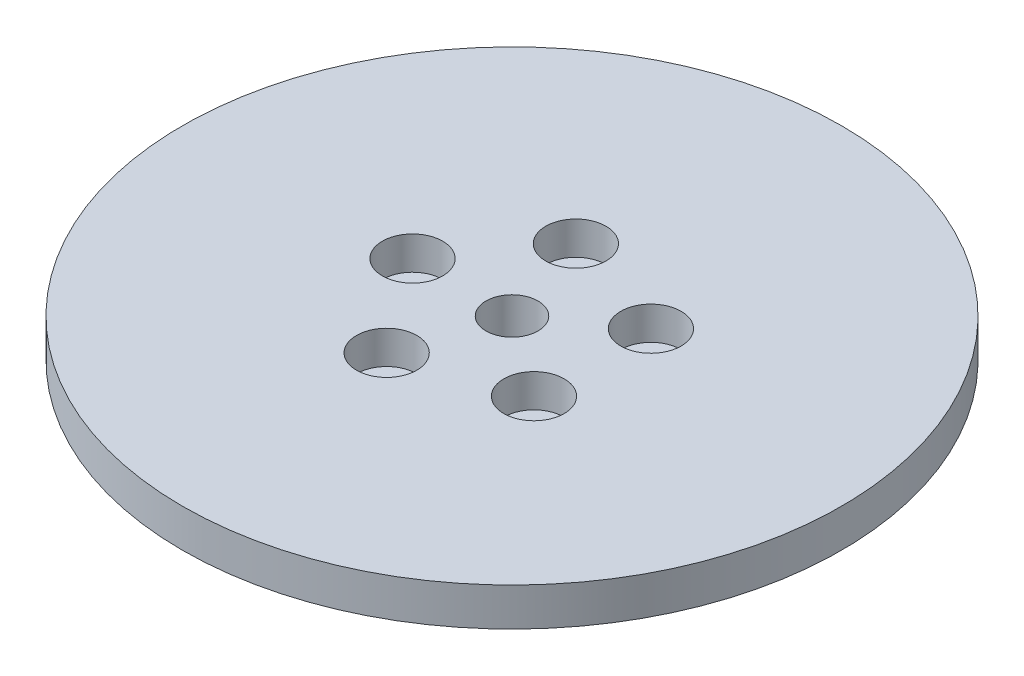
ISO-10303-21;
HEADER;
FILE_DESCRIPTION(('STEP AP214'),'2;1');
FILE_NAME('part.step','',(''),(''),'','','');
FILE_SCHEMA(('AUTOMOTIVE_DESIGN { 1 0 10303 214 1 1 1 1 }'));
ENDSEC;
DATA;
#1=APPLICATION_CONTEXT('core data for automotive mechanical design processes');
#2=APPLICATION_PROTOCOL_DEFINITION('international standard','automotive_design',2000,#1);
#3=PRODUCT_CONTEXT('',#1,'mechanical');
#4=PRODUCT('Part','Part','',(#3));
#5=PRODUCT_RELATED_PRODUCT_CATEGORY('part','',(#4));
#6=PRODUCT_DEFINITION_FORMATION('','',#4);
#7=PRODUCT_DEFINITION_CONTEXT('part definition',#1,'design');
#8=PRODUCT_DEFINITION('design','',#6,#7);
#9=PRODUCT_DEFINITION_SHAPE('','',#8);
#10=(LENGTH_UNIT() NAMED_UNIT(*) SI_UNIT(.MILLI.,.METRE.));
#11=(NAMED_UNIT(*) PLANE_ANGLE_UNIT() SI_UNIT($,.RADIAN.));
#12=(NAMED_UNIT(*) SI_UNIT($,.STERADIAN.) SOLID_ANGLE_UNIT());
#13=UNCERTAINTY_MEASURE_WITH_UNIT(LENGTH_MEASURE(1.E-05),#10,'distance_accuracy_value','');
#14=(GEOMETRIC_REPRESENTATION_CONTEXT(3) GLOBAL_UNCERTAINTY_ASSIGNED_CONTEXT((#13)) GLOBAL_UNIT_ASSIGNED_CONTEXT((#10,
#11,#12)) REPRESENTATION_CONTEXT('',''));
#15=CARTESIAN_POINT('',(0.,0.,0.));
#16=DIRECTION('',(0.,0.,1.));
#17=DIRECTION('',(1.,0.,0.));
#18=AXIS2_PLACEMENT_3D('',#15,#16,#17);
#19=CARTESIAN_POINT('',(0.,11.,0.));
#20=DIRECTION('',(0.,-1.,0.));
#21=DIRECTION('',(0.,0.,-1.));
#22=AXIS2_PLACEMENT_3D('',#19,#20,#21);
#23=CYLINDRICAL_SURFACE('',#22,95.);
#24=CARTESIAN_POINT('',(0.,11.,0.));
#25=DIRECTION('',(0.,1.,0.));
#26=DIRECTION('',(0.,0.,1.));
#27=AXIS2_PLACEMENT_3D('',#24,#25,#26);
#28=CIRCLE('',#27,95.);
#29=CARTESIAN_POINT('',(0.,11.,95.));
#30=VERTEX_POINT('',#29);
#31=EDGE_CURVE('E10',#30,#30,#28,.T.);
#32=ORIENTED_EDGE('',*,*,#31,.F.);
#33=EDGE_LOOP('',(#32));
#34=FACE_BOUND('',#33,.T.);
#35=CARTESIAN_POINT('',(0.,0.,0.));
#36=DIRECTION('',(0.,1.,0.));
#37=DIRECTION('',(0.,0.,1.));
#38=AXIS2_PLACEMENT_3D('',#35,#36,#37);
#39=CIRCLE('',#38,95.);
#40=CARTESIAN_POINT('',(0.,0.,95.));
#41=VERTEX_POINT('',#40);
#42=EDGE_CURVE('E37',#41,#41,#39,.T.);
#43=ORIENTED_EDGE('',*,*,#42,.T.);
#44=EDGE_LOOP('',(#43));
#45=FACE_BOUND('',#44,.T.);
#46=ADVANCED_FACE('F40',(#34,#45),#23,.T.);
#47=CARTESIAN_POINT('',(0.,11.,0.));
#48=DIRECTION('',(0.,1.,0.));
#49=DIRECTION('',(0.,0.,1.));
#50=AXIS2_PLACEMENT_3D('',#47,#48,#49);
#51=PLANE('',#50);
#52=CARTESIAN_POINT('',(-8.86063281050271,11.,-27.270223729838));
#53=DIRECTION('',(0.,1.,0.));
#54=DIRECTION('',(-0.95105651629515,0.,0.309016994374958));
#55=AXIS2_PLACEMENT_3D('',#52,#53,#54);
#56=CIRCLE('',#55,8.69065040809146);
#57=CARTESIAN_POINT('',(-17.1259325119612,11.,-24.5846650615661));
#58=VERTEX_POINT('',#57);
#59=EDGE_CURVE('E70',#58,#58,#56,.T.);
#60=ORIENTED_EDGE('',*,*,#59,.F.);
#61=EDGE_LOOP('',(#60));
#62=FACE_BOUND('',#61,.T.);
#63=CARTESIAN_POINT('',(23.1974378597276,11.,-16.8539251458541));
#64=DIRECTION('',(0.,1.,0.));
#65=DIRECTION('',(-0.58778525229248,0.,-0.809016994374942));
#66=AXIS2_PLACEMENT_3D('',#63,#64,#65);
#67=CIRCLE('',#66,8.69065040809146);
#68=CARTESIAN_POINT('',(18.0892017170219,11.,-23.8848090181716));
#69=VERTEX_POINT('',#68);
#70=EDGE_CURVE('E71',#69,#69,#67,.T.);
#71=ORIENTED_EDGE('',*,*,#70,.F.);
#72=EDGE_LOOP('',(#71));
#73=FACE_BOUND('',#72,.T.);
#74=CARTESIAN_POINT('',(23.1974378597279,11.,16.8539251458538));
#75=DIRECTION('',(0.,1.,0.));
#76=DIRECTION('',(0.587785252292469,0.,-0.809016994374951));
#77=AXIS2_PLACEMENT_3D('',#74,#75,#76);
#78=CIRCLE('',#77,8.69065040809146);
#79=CARTESIAN_POINT('',(28.3056740024336,11.,9.82304127353618));
#80=VERTEX_POINT('',#79);
#81=EDGE_CURVE('E78',#80,#80,#78,.T.);
#82=ORIENTED_EDGE('',*,*,#81,.F.);
#83=EDGE_LOOP('',(#82));
#84=FACE_BOUND('',#83,.T.);
#85=CARTESIAN_POINT('',(-8.86063281050233,11.,27.2702237298382));
#86=DIRECTION('',(0.,1.,0.));
#87=DIRECTION('',(0.951056516295155,0.,0.309016994374945));
#88=AXIS2_PLACEMENT_3D('',#85,#86,#87);
#89=CIRCLE('',#88,8.69065040809146);
#90=CARTESIAN_POINT('',(-0.595333109043798,11.,29.95578239811));
#91=VERTEX_POINT('',#90);
#92=EDGE_CURVE('E61',#91,#91,#89,.T.);
#93=ORIENTED_EDGE('',*,*,#92,.F.);
#94=EDGE_LOOP('',(#93));
#95=FACE_BOUND('',#94,.T.);
#96=CARTESIAN_POINT('',(-28.6736100984508,11.,0.));
#97=DIRECTION('',(0.,1.,0.));
#98=DIRECTION('',(0.,0.,1.));
#99=AXIS2_PLACEMENT_3D('',#96,#97,#98);
#100=CIRCLE('',#99,8.69065040809146);
#101=CARTESIAN_POINT('',(-28.6736100984508,11.,8.69065040809146));
#102=VERTEX_POINT('',#101);
#103=EDGE_CURVE('E54',#102,#102,#100,.T.);
#104=ORIENTED_EDGE('',*,*,#103,.F.);
#105=EDGE_LOOP('',(#104));
#106=FACE_BOUND('',#105,.T.);
#107=CARTESIAN_POINT('',(0.,11.,0.));
#108=DIRECTION('',(0.,1.,0.));
#109=DIRECTION('',(0.,0.,1.));
#110=AXIS2_PLACEMENT_3D('',#107,#108,#109);
#111=CIRCLE('',#110,7.5);
#112=CARTESIAN_POINT('',(0.,11.,7.5));
#113=VERTEX_POINT('',#112);
#114=EDGE_CURVE('E50',#113,#113,#111,.T.);
#115=ORIENTED_EDGE('',*,*,#114,.F.);
#116=EDGE_LOOP('',(#115));
#117=FACE_BOUND('',#116,.T.);
#118=ORIENTED_EDGE('',*,*,#31,.T.);
#119=EDGE_LOOP('',(#118));
#120=FACE_BOUND('',#119,.T.);
#121=ADVANCED_FACE('F94',(#62,#73,#84,#95,#106,#117,#120),#51,.T.);
#122=CARTESIAN_POINT('',(0.,0.,0.));
#123=DIRECTION('',(0.,1.,0.));
#124=DIRECTION('',(0.,0.,1.));
#125=AXIS2_PLACEMENT_3D('',#122,#123,#124);
#126=PLANE('',#125);
#127=CARTESIAN_POINT('',(0.,0.,0.));
#128=DIRECTION('',(0.,1.,0.));
#129=DIRECTION('',(0.,0.,1.));
#130=AXIS2_PLACEMENT_3D('',#127,#128,#129);
#131=CIRCLE('',#130,7.5);
#132=CARTESIAN_POINT('',(0.,0.,7.5));
#133=VERTEX_POINT('',#132);
#134=EDGE_CURVE('E47',#133,#133,#131,.T.);
#135=ORIENTED_EDGE('',*,*,#134,.T.);
#136=EDGE_LOOP('',(#135));
#137=FACE_BOUND('',#136,.T.);
#138=ORIENTED_EDGE('',*,*,#42,.F.);
#139=EDGE_LOOP('',(#138));
#140=FACE_BOUND('',#139,.T.);
#141=ADVANCED_FACE('F100',(#137,#140),#126,.F.);
#142=CARTESIAN_POINT('',(0.,11.,0.));
#143=DIRECTION('',(0.,-1.,0.));
#144=DIRECTION('',(0.,0.,-1.));
#145=AXIS2_PLACEMENT_3D('',#142,#143,#144);
#146=CYLINDRICAL_SURFACE('',#145,7.5);
#147=ORIENTED_EDGE('',*,*,#114,.T.);
#148=EDGE_LOOP('',(#147));
#149=FACE_BOUND('',#148,.T.);
#150=ORIENTED_EDGE('',*,*,#134,.F.);
#151=EDGE_LOOP('',(#150));
#152=FACE_BOUND('',#151,.T.);
#153=ADVANCED_FACE('F106',(#149,#152),#146,.F.);
#154=CARTESIAN_POINT('',(-28.6736100984508,1.44149925813768,0.));
#155=DIRECTION('',(0.,1.,0.));
#156=DIRECTION('',(0.,0.,1.));
#157=AXIS2_PLACEMENT_3D('',#154,#155,#156);
#158=CYLINDRICAL_SURFACE('',#157,8.69065040809146);
#159=CARTESIAN_POINT('',(-28.6736100984508,1.44149925813768,0.));
#160=DIRECTION('',(0.,1.,0.));
#161=DIRECTION('',(0.,0.,1.));
#162=AXIS2_PLACEMENT_3D('',#159,#160,#161);
#163=CIRCLE('',#162,8.69065040809146);
#164=CARTESIAN_POINT('',(-28.6736100984508,1.44149925813768,8.69065040809146));
#165=VERTEX_POINT('',#164);
#166=EDGE_CURVE('E55',#165,#165,#163,.T.);
#167=ORIENTED_EDGE('',*,*,#166,.F.);
#168=EDGE_LOOP('',(#167));
#169=FACE_BOUND('',#168,.T.);
#170=ORIENTED_EDGE('',*,*,#103,.T.);
#171=EDGE_LOOP('',(#170));
#172=FACE_BOUND('',#171,.T.);
#173=ADVANCED_FACE('F108',(#169,#172),#158,.F.);
#174=CARTESIAN_POINT('',(-28.6736100984508,1.44149925813768,0.));
#175=DIRECTION('',(0.,1.,0.));
#176=DIRECTION('',(0.,0.,1.));
#177=AXIS2_PLACEMENT_3D('',#174,#175,#176);
#178=PLANE('',#177);
#179=ORIENTED_EDGE('',*,*,#166,.T.);
#180=EDGE_LOOP('',(#179));
#181=FACE_BOUND('',#180,.T.);
#182=ADVANCED_FACE('F138',(#181),#178,.T.);
#183=CARTESIAN_POINT('',(-8.86063281050233,1.44149925813768,27.2702237298382));
#184=DIRECTION('',(0.,1.,0.));
#185=DIRECTION('',(0.,0.,1.));
#186=AXIS2_PLACEMENT_3D('',#183,#184,#185);
#187=CYLINDRICAL_SURFACE('',#186,8.69065040809146);
#188=CARTESIAN_POINT('',(-8.86063281050233,1.44149925813768,27.2702237298382));
#189=DIRECTION('',(0.,1.,0.));
#190=DIRECTION('',(0.951056516295155,0.,0.309016994374945));
#191=AXIS2_PLACEMENT_3D('',#188,#189,#190);
#192=CIRCLE('',#191,8.69065040809146);
#193=CARTESIAN_POINT('',(-0.595333109043798,1.44149925813768,29.95578239811));
#194=VERTEX_POINT('',#193);
#195=EDGE_CURVE('E59',#194,#194,#192,.T.);
#196=ORIENTED_EDGE('',*,*,#195,.F.);
#197=EDGE_LOOP('',(#196));
#198=FACE_BOUND('',#197,.T.);
#199=ORIENTED_EDGE('',*,*,#92,.T.);
#200=EDGE_LOOP('',(#199));
#201=FACE_BOUND('',#200,.T.);
#202=ADVANCED_FACE('F150',(#198,#201),#187,.F.);
#203=CARTESIAN_POINT('',(-8.86063281050233,1.44149925813768,27.2702237298382));
#204=DIRECTION('',(0.,1.,0.));
#205=DIRECTION('',(0.951056516295155,0.,0.309016994374945));
#206=AXIS2_PLACEMENT_3D('',#203,#204,#205);
#207=PLANE('',#206);
#208=ORIENTED_EDGE('',*,*,#195,.T.);
#209=EDGE_LOOP('',(#208));
#210=FACE_BOUND('',#209,.T.);
#211=ADVANCED_FACE('F89',(#210),#207,.T.);
#212=CARTESIAN_POINT('',(23.1974378597279,1.44149925813768,16.8539251458538));
#213=DIRECTION('',(0.,1.,0.));
#214=DIRECTION('',(0.,0.,1.));
#215=AXIS2_PLACEMENT_3D('',#212,#213,#214);
#216=CYLINDRICAL_SURFACE('',#215,8.69065040809146);
#217=CARTESIAN_POINT('',(23.1974378597279,1.44149925813768,16.8539251458538));
#218=DIRECTION('',(0.,1.,0.));
#219=DIRECTION('',(0.587785252292469,0.,-0.809016994374951));
#220=AXIS2_PLACEMENT_3D('',#217,#218,#219);
#221=CIRCLE('',#220,8.69065040809146);
#222=CARTESIAN_POINT('',(28.3056740024336,1.44149925813768,9.82304127353618));
#223=VERTEX_POINT('',#222);
#224=EDGE_CURVE('E63',#223,#223,#221,.T.);
#225=ORIENTED_EDGE('',*,*,#224,.F.);
#226=EDGE_LOOP('',(#225));
#227=FACE_BOUND('',#226,.T.);
#228=ORIENTED_EDGE('',*,*,#81,.T.);
#229=EDGE_LOOP('',(#228));
#230=FACE_BOUND('',#229,.T.);
#231=ADVANCED_FACE('F87',(#227,#230),#216,.F.);
#232=CARTESIAN_POINT('',(23.1974378597279,1.44149925813768,16.8539251458538));
#233=DIRECTION('',(0.,1.,0.));
#234=DIRECTION('',(0.587785252292469,0.,-0.809016994374951));
#235=AXIS2_PLACEMENT_3D('',#232,#233,#234);
#236=PLANE('',#235);
#237=ORIENTED_EDGE('',*,*,#224,.T.);
#238=EDGE_LOOP('',(#237));
#239=FACE_BOUND('',#238,.T.);
#240=ADVANCED_FACE('F84',(#239),#236,.T.);
#241=CARTESIAN_POINT('',(23.1974378597276,1.44149925813768,-16.8539251458541));
#242=DIRECTION('',(0.,1.,0.));
#243=DIRECTION('',(0.,0.,1.));
#244=AXIS2_PLACEMENT_3D('',#241,#242,#243);
#245=CYLINDRICAL_SURFACE('',#244,8.69065040809146);
#246=CARTESIAN_POINT('',(23.1974378597276,1.44149925813768,-16.8539251458541));
#247=DIRECTION('',(0.,1.,0.));
#248=DIRECTION('',(-0.58778525229248,0.,-0.809016994374942));
#249=AXIS2_PLACEMENT_3D('',#246,#247,#248);
#250=CIRCLE('',#249,8.69065040809146);
#251=CARTESIAN_POINT('',(18.0892017170219,1.44149925813768,-23.8848090181716));
#252=VERTEX_POINT('',#251);
#253=EDGE_CURVE('E76',#252,#252,#250,.T.);
#254=ORIENTED_EDGE('',*,*,#253,.F.);
#255=EDGE_LOOP('',(#254));
#256=FACE_BOUND('',#255,.T.);
#257=ORIENTED_EDGE('',*,*,#70,.T.);
#258=EDGE_LOOP('',(#257));
#259=FACE_BOUND('',#258,.T.);
#260=ADVANCED_FACE('F185',(#256,#259),#245,.F.);
#261=CARTESIAN_POINT('',(23.1974378597276,1.44149925813768,-16.8539251458541));
#262=DIRECTION('',(0.,1.,0.));
#263=DIRECTION('',(-0.58778525229248,0.,-0.809016994374942));
#264=AXIS2_PLACEMENT_3D('',#261,#262,#263);
#265=PLANE('',#264);
#266=ORIENTED_EDGE('',*,*,#253,.T.);
#267=EDGE_LOOP('',(#266));
#268=FACE_BOUND('',#267,.T.);
#269=ADVANCED_FACE('F189',(#268),#265,.T.);
#270=CARTESIAN_POINT('',(-8.86063281050271,1.44149925813768,-27.270223729838));
#271=DIRECTION('',(0.,1.,0.));
#272=DIRECTION('',(0.,0.,1.));
#273=AXIS2_PLACEMENT_3D('',#270,#271,#272);
#274=CYLINDRICAL_SURFACE('',#273,8.69065040809146);
#275=CARTESIAN_POINT('',(-8.86063281050271,1.44149925813768,-27.270223729838));
#276=DIRECTION('',(0.,1.,0.));
#277=DIRECTION('',(-0.95105651629515,0.,0.309016994374958));
#278=AXIS2_PLACEMENT_3D('',#275,#276,#277);
#279=CIRCLE('',#278,8.69065040809146);
#280=CARTESIAN_POINT('',(-17.1259325119612,1.44149925813768,-24.5846650615661));
#281=VERTEX_POINT('',#280);
#282=EDGE_CURVE('E69',#281,#281,#279,.T.);
#283=ORIENTED_EDGE('',*,*,#282,.F.);
#284=EDGE_LOOP('',(#283));
#285=FACE_BOUND('',#284,.T.);
#286=ORIENTED_EDGE('',*,*,#59,.T.);
#287=EDGE_LOOP('',(#286));
#288=FACE_BOUND('',#287,.T.);
#289=ADVANCED_FACE('F200',(#285,#288),#274,.F.);
#290=CARTESIAN_POINT('',(-8.86063281050271,1.44149925813768,-27.270223729838));
#291=DIRECTION('',(0.,1.,0.));
#292=DIRECTION('',(-0.95105651629515,0.,0.309016994374958));
#293=AXIS2_PLACEMENT_3D('',#290,#291,#292);
#294=PLANE('',#293);
#295=ORIENTED_EDGE('',*,*,#282,.T.);
#296=EDGE_LOOP('',(#295));
#297=FACE_BOUND('',#296,.T.);
#298=ADVANCED_FACE('F208',(#297),#294,.T.);
#299=CLOSED_SHELL('',(#46,#121,#141,#153,#173,#182,#202,#211,#231,#240,#260,#269,#289,#298));
#300=MANIFOLD_SOLID_BREP('B2',#299);
#301=ADVANCED_BREP_SHAPE_REPRESENTATION('',(#18,#300),#14);
#302=SHAPE_DEFINITION_REPRESENTATION(#9,#301);
ENDSEC;
END-ISO-10303-21;
